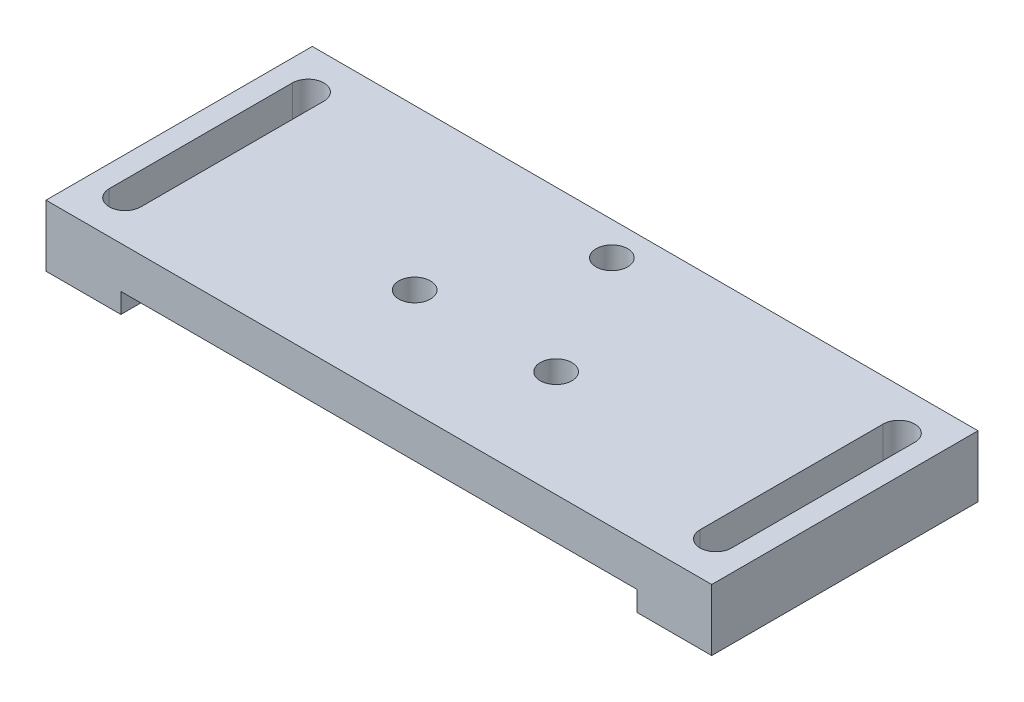
ISO-10303-21;
HEADER;
FILE_DESCRIPTION(('STEP AP214'),'2;1');
FILE_NAME('part.step','',(''),(''),'','','');
FILE_SCHEMA(('AUTOMOTIVE_DESIGN { 1 0 10303 214 1 1 1 1 }'));
ENDSEC;
DATA;
#1=APPLICATION_CONTEXT('core data for automotive mechanical design processes');
#2=APPLICATION_PROTOCOL_DEFINITION('international standard','automotive_design',2000,#1);
#3=PRODUCT_CONTEXT('',#1,'mechanical');
#4=PRODUCT('Part','Part','',(#3));
#5=PRODUCT_RELATED_PRODUCT_CATEGORY('part','',(#4));
#6=PRODUCT_DEFINITION_FORMATION('','',#4);
#7=PRODUCT_DEFINITION_CONTEXT('part definition',#1,'design');
#8=PRODUCT_DEFINITION('design','',#6,#7);
#9=PRODUCT_DEFINITION_SHAPE('','',#8);
#10=(LENGTH_UNIT() NAMED_UNIT(*) SI_UNIT(.MILLI.,.METRE.));
#11=(NAMED_UNIT(*) PLANE_ANGLE_UNIT() SI_UNIT($,.RADIAN.));
#12=(NAMED_UNIT(*) SI_UNIT($,.STERADIAN.) SOLID_ANGLE_UNIT());
#13=UNCERTAINTY_MEASURE_WITH_UNIT(LENGTH_MEASURE(1.E-05),#10,'distance_accuracy_value','');
#14=(GEOMETRIC_REPRESENTATION_CONTEXT(3) GLOBAL_UNCERTAINTY_ASSIGNED_CONTEXT((#13)) GLOBAL_UNIT_ASSIGNED_CONTEXT((#10,
#11,#12)) REPRESENTATION_CONTEXT('',''));
#15=CARTESIAN_POINT('',(0.,0.,0.));
#16=DIRECTION('',(0.,0.,1.));
#17=DIRECTION('',(1.,0.,0.));
#18=AXIS2_PLACEMENT_3D('',#15,#16,#17);
#19=CARTESIAN_POINT('',(0.,2.5,0.));
#20=DIRECTION('',(0.,-1.,0.));
#21=DIRECTION('',(0.,0.,-1.));
#22=AXIS2_PLACEMENT_3D('',#19,#20,#21);
#23=PLANE('',#22);
#24=CARTESIAN_POINT('',(4.25,2.5,1.6));
#25=DIRECTION('',(0.,1.,0.));
#26=DIRECTION('',(0.,0.,1.));
#27=AXIS2_PLACEMENT_3D('',#24,#25,#26);
#28=CIRCLE('',#27,0.95);
#29=CARTESIAN_POINT('',(4.25,2.5,2.55));
#30=VERTEX_POINT('',#29);
#31=EDGE_CURVE('E279',#30,#30,#28,.T.);
#32=ORIENTED_EDGE('',*,*,#31,.F.);
#33=EDGE_LOOP('',(#32));
#34=FACE_BOUND('',#33,.T.);
#35=CARTESIAN_POINT('',(-4.25,2.5,1.6));
#36=DIRECTION('',(0.,1.,0.));
#37=DIRECTION('',(0.,0.,1.));
#38=AXIS2_PLACEMENT_3D('',#35,#36,#37);
#39=CIRCLE('',#38,0.95);
#40=CARTESIAN_POINT('',(-4.25,2.5,2.55));
#41=VERTEX_POINT('',#40);
#42=EDGE_CURVE('E538',#41,#41,#39,.T.);
#43=ORIENTED_EDGE('',*,*,#42,.F.);
#44=EDGE_LOOP('',(#43));
#45=FACE_BOUND('',#44,.T.);
#46=CARTESIAN_POINT('',(0.,2.5,-6.));
#47=DIRECTION('',(0.,1.,0.));
#48=DIRECTION('',(0.,0.,1.));
#49=AXIS2_PLACEMENT_3D('',#46,#47,#48);
#50=CIRCLE('',#49,0.95);
#51=CARTESIAN_POINT('',(0.,2.5,-5.05));
#52=VERTEX_POINT('',#51);
#53=EDGE_CURVE('E170',#52,#52,#50,.T.);
#54=ORIENTED_EDGE('',*,*,#53,.F.);
#55=EDGE_LOOP('',(#54));
#56=FACE_BOUND('',#55,.T.);
#57=DIRECTION('',(0.,0.,-1.));
#58=VECTOR('',#57,1.);
#59=CARTESIAN_POINT('',(20.,2.5,8.));
#60=LINE('',#59,#58);
#61=CARTESIAN_POINT('',(20.,2.5,8.));
#62=VERTEX_POINT('',#61);
#63=CARTESIAN_POINT('',(20.,2.5,-8.));
#64=VERTEX_POINT('',#63);
#65=EDGE_CURVE('E258',#62,#64,#60,.T.);
#66=ORIENTED_EDGE('',*,*,#65,.T.);
#67=DIRECTION('',(-1.,0.,0.));
#68=VECTOR('',#67,1.);
#69=CARTESIAN_POINT('',(-20.,2.5,-8.));
#70=LINE('',#69,#68);
#71=CARTESIAN_POINT('',(-20.,2.5,-8.));
#72=VERTEX_POINT('',#71);
#73=EDGE_CURVE('E261',#64,#72,#70,.T.);
#74=ORIENTED_EDGE('',*,*,#73,.T.);
#75=DIRECTION('',(0.,0.,1.));
#76=VECTOR('',#75,1.);
#77=CARTESIAN_POINT('',(-20.,2.5,8.));
#78=LINE('',#77,#76);
#79=CARTESIAN_POINT('',(-20.,2.5,8.));
#80=VERTEX_POINT('',#79);
#81=EDGE_CURVE('E264',#72,#80,#78,.T.);
#82=ORIENTED_EDGE('',*,*,#81,.T.);
#83=DIRECTION('',(1.,0.,0.));
#84=VECTOR('',#83,1.);
#85=CARTESIAN_POINT('',(-20.,2.5,8.));
#86=LINE('',#85,#84);
#87=EDGE_CURVE('E266',#80,#62,#86,.T.);
#88=ORIENTED_EDGE('',*,*,#87,.T.);
#89=EDGE_LOOP('',(#66,#74,#82,#88));
#90=FACE_BOUND('',#89,.T.);
#91=DIRECTION('',(0.,0.,1.));
#92=VECTOR('',#91,1.);
#93=CARTESIAN_POINT('',(-16.8,2.5,5.5));
#94=LINE('',#93,#92);
#95=CARTESIAN_POINT('',(-16.8,2.5,-5.5));
#96=VERTEX_POINT('',#95);
#97=CARTESIAN_POINT('',(-16.8,2.5,5.5));
#98=VERTEX_POINT('',#97);
#99=EDGE_CURVE('E215',#96,#98,#94,.T.);
#100=ORIENTED_EDGE('',*,*,#99,.T.);
#101=CARTESIAN_POINT('',(-17.75,2.5,5.5));
#102=DIRECTION('',(0.,-1.,0.));
#103=DIRECTION('',(0.,0.,-1.));
#104=AXIS2_PLACEMENT_3D('',#101,#102,#103);
#105=CIRCLE('',#104,0.950000000000003);
#106=CARTESIAN_POINT('',(-18.7,2.5,5.5));
#107=VERTEX_POINT('',#106);
#108=EDGE_CURVE('E205',#98,#107,#105,.T.);
#109=ORIENTED_EDGE('',*,*,#108,.T.);
#110=DIRECTION('',(0.,0.,-1.));
#111=VECTOR('',#110,1.);
#112=CARTESIAN_POINT('',(-18.7,2.5,5.5));
#113=LINE('',#112,#111);
#114=CARTESIAN_POINT('',(-18.7,2.5,-5.5));
#115=VERTEX_POINT('',#114);
#116=EDGE_CURVE('E208',#107,#115,#113,.T.);
#117=ORIENTED_EDGE('',*,*,#116,.T.);
#118=CARTESIAN_POINT('',(-17.75,2.5,-5.5));
#119=DIRECTION('',(0.,-1.,0.));
#120=DIRECTION('',(0.,0.,-1.));
#121=AXIS2_PLACEMENT_3D('',#118,#119,#120);
#122=CIRCLE('',#121,0.950000000000005);
#123=EDGE_CURVE('E212',#115,#96,#122,.T.);
#124=ORIENTED_EDGE('',*,*,#123,.T.);
#125=EDGE_LOOP('',(#100,#109,#117,#124));
#126=FACE_BOUND('',#125,.T.);
#127=CARTESIAN_POINT('',(17.75,2.5,5.5));
#128=DIRECTION('',(0.,1.,0.));
#129=DIRECTION('',(0.,0.,-1.));
#130=AXIS2_PLACEMENT_3D('',#127,#128,#129);
#131=CIRCLE('',#130,0.950000000000003);
#132=CARTESIAN_POINT('',(16.8,2.5,5.5));
#133=VERTEX_POINT('',#132);
#134=CARTESIAN_POINT('',(18.7,2.5,5.5));
#135=VERTEX_POINT('',#134);
#136=EDGE_CURVE('E157',#133,#135,#131,.T.);
#137=ORIENTED_EDGE('',*,*,#136,.F.);
#138=DIRECTION('',(0.,0.,1.));
#139=VECTOR('',#138,1.);
#140=CARTESIAN_POINT('',(16.8,2.5,5.5));
#141=LINE('',#140,#139);
#142=CARTESIAN_POINT('',(16.8,2.5,-5.5));
#143=VERTEX_POINT('',#142);
#144=EDGE_CURVE('E149',#143,#133,#141,.T.);
#145=ORIENTED_EDGE('',*,*,#144,.F.);
#146=CARTESIAN_POINT('',(17.75,2.5,-5.5));
#147=DIRECTION('',(0.,1.,0.));
#148=DIRECTION('',(0.,0.,-1.));
#149=AXIS2_PLACEMENT_3D('',#146,#147,#148);
#150=CIRCLE('',#149,0.950000000000005);
#151=CARTESIAN_POINT('',(18.7,2.5,-5.5));
#152=VERTEX_POINT('',#151);
#153=EDGE_CURVE('E156',#152,#143,#150,.T.);
#154=ORIENTED_EDGE('',*,*,#153,.F.);
#155=DIRECTION('',(0.,0.,-1.));
#156=VECTOR('',#155,1.);
#157=CARTESIAN_POINT('',(18.7,2.5,5.5));
#158=LINE('',#157,#156);
#159=EDGE_CURVE('E161',#135,#152,#158,.T.);
#160=ORIENTED_EDGE('',*,*,#159,.F.);
#161=EDGE_LOOP('',(#137,#145,#154,#160));
#162=FACE_BOUND('',#161,.T.);
#163=ADVANCED_FACE('F35',(#34,#45,#56,#90,#126,#162),#23,.F.);
#164=CARTESIAN_POINT('',(0.,-1.2,0.));
#165=DIRECTION('',(0.,-1.,0.));
#166=DIRECTION('',(0.,0.,-1.));
#167=AXIS2_PLACEMENT_3D('',#164,#165,#166);
#168=PLANE('',#167);
#169=DIRECTION('',(0.,0.,-1.));
#170=VECTOR('',#169,1.);
#171=CARTESIAN_POINT('',(20.,-1.2,8.));
#172=LINE('',#171,#170);
#173=CARTESIAN_POINT('',(20.,-1.2,8.));
#174=VERTEX_POINT('',#173);
#175=CARTESIAN_POINT('',(20.,-1.2,-8.));
#176=VERTEX_POINT('',#175);
#177=EDGE_CURVE('E192',#174,#176,#172,.T.);
#178=ORIENTED_EDGE('',*,*,#177,.F.);
#179=DIRECTION('',(1.,0.,0.));
#180=VECTOR('',#179,1.);
#181=CARTESIAN_POINT('',(20.,-1.2,8.));
#182=LINE('',#181,#180);
#183=CARTESIAN_POINT('',(15.5,-1.2,8.));
#184=VERTEX_POINT('',#183);
#185=EDGE_CURVE('E196',#184,#174,#182,.T.);
#186=ORIENTED_EDGE('',*,*,#185,.F.);
#187=DIRECTION('',(0.,0.,1.));
#188=VECTOR('',#187,1.);
#189=CARTESIAN_POINT('',(15.5,-1.2,8.));
#190=LINE('',#189,#188);
#191=CARTESIAN_POINT('',(15.5,-1.2,-8.));
#192=VERTEX_POINT('',#191);
#193=EDGE_CURVE('E200',#192,#184,#190,.T.);
#194=ORIENTED_EDGE('',*,*,#193,.F.);
#195=DIRECTION('',(-1.,0.,0.));
#196=VECTOR('',#195,1.);
#197=CARTESIAN_POINT('',(20.,-1.2,-8.));
#198=LINE('',#197,#196);
#199=EDGE_CURVE('E188',#176,#192,#198,.T.);
#200=ORIENTED_EDGE('',*,*,#199,.F.);
#201=EDGE_LOOP('',(#178,#186,#194,#200));
#202=FACE_BOUND('',#201,.T.);
#203=DIRECTION('',(0.,0.,1.));
#204=VECTOR('',#203,1.);
#205=CARTESIAN_POINT('',(16.8,-1.2,5.5));
#206=LINE('',#205,#204);
#207=CARTESIAN_POINT('',(16.8,-1.2,-5.5));
#208=VERTEX_POINT('',#207);
#209=CARTESIAN_POINT('',(16.8,-1.2,5.5));
#210=VERTEX_POINT('',#209);
#211=EDGE_CURVE('E176',#208,#210,#206,.T.);
#212=ORIENTED_EDGE('',*,*,#211,.T.);
#213=CARTESIAN_POINT('',(17.75,-1.2,5.5));
#214=DIRECTION('',(0.,1.,0.));
#215=DIRECTION('',(0.,0.,-1.));
#216=AXIS2_PLACEMENT_3D('',#213,#214,#215);
#217=CIRCLE('',#216,0.950000000000003);
#218=CARTESIAN_POINT('',(18.7,-1.2,5.5));
#219=VERTEX_POINT('',#218);
#220=EDGE_CURVE('E60',#210,#219,#217,.T.);
#221=ORIENTED_EDGE('',*,*,#220,.T.);
#222=DIRECTION('',(0.,0.,-1.));
#223=VECTOR('',#222,1.);
#224=CARTESIAN_POINT('',(18.7,-1.2,5.5));
#225=LINE('',#224,#223);
#226=CARTESIAN_POINT('',(18.7,-1.2,-5.5));
#227=VERTEX_POINT('',#226);
#228=EDGE_CURVE('E164',#219,#227,#225,.T.);
#229=ORIENTED_EDGE('',*,*,#228,.T.);
#230=CARTESIAN_POINT('',(17.75,-1.2,-5.5));
#231=DIRECTION('',(0.,1.,0.));
#232=DIRECTION('',(0.,0.,-1.));
#233=AXIS2_PLACEMENT_3D('',#230,#231,#232);
#234=CIRCLE('',#233,0.950000000000005);
#235=EDGE_CURVE('E167',#227,#208,#234,.T.);
#236=ORIENTED_EDGE('',*,*,#235,.T.);
#237=EDGE_LOOP('',(#212,#221,#229,#236));
#238=FACE_BOUND('',#237,.T.);
#239=ADVANCED_FACE('F329',(#202,#238),#168,.T.);
#240=CARTESIAN_POINT('',(20.,2.5,8.));
#241=DIRECTION('',(-1.,0.,0.));
#242=DIRECTION('',(0.,0.,1.));
#243=AXIS2_PLACEMENT_3D('',#240,#241,#242);
#244=PLANE('',#243);
#245=DIRECTION('',(0.,-1.,0.));
#246=VECTOR('',#245,1.);
#247=CARTESIAN_POINT('',(20.,2.5,8.));
#248=LINE('',#247,#246);
#249=EDGE_CURVE('E268',#62,#174,#248,.T.);
#250=ORIENTED_EDGE('',*,*,#249,.T.);
#251=ORIENTED_EDGE('',*,*,#177,.T.);
#252=DIRECTION('',(0.,-1.,0.));
#253=VECTOR('',#252,1.);
#254=CARTESIAN_POINT('',(20.,2.5,-8.));
#255=LINE('',#254,#253);
#256=EDGE_CURVE('E12',#64,#176,#255,.T.);
#257=ORIENTED_EDGE('',*,*,#256,.F.);
#258=ORIENTED_EDGE('',*,*,#65,.F.);
#259=EDGE_LOOP('',(#250,#251,#257,#258));
#260=FACE_BOUND('',#259,.T.);
#261=ADVANCED_FACE('F37',(#260),#244,.F.);
#262=CARTESIAN_POINT('',(-20.,2.5,-8.));
#263=DIRECTION('',(0.,0.,1.));
#264=DIRECTION('',(1.,0.,0.));
#265=AXIS2_PLACEMENT_3D('',#262,#263,#264);
#266=PLANE('',#265);
#267=ORIENTED_EDGE('',*,*,#256,.T.);
#268=ORIENTED_EDGE('',*,*,#199,.T.);
#269=DIRECTION('',(0.,1.,0.));
#270=VECTOR('',#269,1.);
#271=CARTESIAN_POINT('',(15.5,-21.5207701385947,-8.));
#272=LINE('',#271,#270);
#273=CARTESIAN_POINT('',(15.5,0.,-8.));
#274=VERTEX_POINT('',#273);
#275=EDGE_CURVE('E191',#192,#274,#272,.T.);
#276=ORIENTED_EDGE('',*,*,#275,.T.);
#277=DIRECTION('',(-1.,0.,0.));
#278=VECTOR('',#277,1.);
#279=CARTESIAN_POINT('',(-20.,0.,-8.));
#280=LINE('',#279,#278);
#281=CARTESIAN_POINT('',(-15.5,0.,-8.));
#282=VERTEX_POINT('',#281);
#283=EDGE_CURVE('E244',#274,#282,#280,.T.);
#284=ORIENTED_EDGE('',*,*,#283,.T.);
#285=DIRECTION('',(0.,1.,0.));
#286=VECTOR('',#285,1.);
#287=CARTESIAN_POINT('',(-15.5,-21.5207701385947,-8.));
#288=LINE('',#287,#286);
#289=CARTESIAN_POINT('',(-15.5,-1.2,-8.));
#290=VERTEX_POINT('',#289);
#291=EDGE_CURVE('E230',#290,#282,#288,.T.);
#292=ORIENTED_EDGE('',*,*,#291,.F.);
#293=DIRECTION('',(1.,0.,0.));
#294=VECTOR('',#293,1.);
#295=CARTESIAN_POINT('',(-20.,-1.2,-8.));
#296=LINE('',#295,#294);
#297=CARTESIAN_POINT('',(-20.,-1.2,-8.));
#298=VERTEX_POINT('',#297);
#299=EDGE_CURVE('E245',#298,#290,#296,.T.);
#300=ORIENTED_EDGE('',*,*,#299,.F.);
#301=DIRECTION('',(0.,-1.,0.));
#302=VECTOR('',#301,1.);
#303=CARTESIAN_POINT('',(-20.,2.5,-8.));
#304=LINE('',#303,#302);
#305=EDGE_CURVE('E44',#72,#298,#304,.T.);
#306=ORIENTED_EDGE('',*,*,#305,.F.);
#307=ORIENTED_EDGE('',*,*,#73,.F.);
#308=EDGE_LOOP('',(#267,#268,#276,#284,#292,#300,#306,#307));
#309=FACE_BOUND('',#308,.T.);
#310=ADVANCED_FACE('F310',(#309),#266,.F.);
#311=CARTESIAN_POINT('',(-20.,2.5,8.));
#312=DIRECTION('',(1.,0.,0.));
#313=DIRECTION('',(0.,0.,-1.));
#314=AXIS2_PLACEMENT_3D('',#311,#312,#313);
#315=PLANE('',#314);
#316=ORIENTED_EDGE('',*,*,#305,.T.);
#317=DIRECTION('',(0.,0.,-1.));
#318=VECTOR('',#317,1.);
#319=CARTESIAN_POINT('',(-20.,-1.2,8.));
#320=LINE('',#319,#318);
#321=CARTESIAN_POINT('',(-20.,-1.2,8.));
#322=VERTEX_POINT('',#321);
#323=EDGE_CURVE('E248',#322,#298,#320,.T.);
#324=ORIENTED_EDGE('',*,*,#323,.F.);
#325=DIRECTION('',(0.,-1.,0.));
#326=VECTOR('',#325,1.);
#327=CARTESIAN_POINT('',(-20.,2.5,8.));
#328=LINE('',#327,#326);
#329=EDGE_CURVE('E273',#80,#322,#328,.T.);
#330=ORIENTED_EDGE('',*,*,#329,.F.);
#331=ORIENTED_EDGE('',*,*,#81,.F.);
#332=EDGE_LOOP('',(#316,#324,#330,#331));
#333=FACE_BOUND('',#332,.T.);
#334=ADVANCED_FACE('F317',(#333),#315,.F.);
#335=CARTESIAN_POINT('',(-20.,2.5,8.));
#336=DIRECTION('',(0.,0.,-1.));
#337=DIRECTION('',(-1.,0.,0.));
#338=AXIS2_PLACEMENT_3D('',#335,#336,#337);
#339=PLANE('',#338);
#340=ORIENTED_EDGE('',*,*,#329,.T.);
#341=DIRECTION('',(-1.,0.,0.));
#342=VECTOR('',#341,1.);
#343=CARTESIAN_POINT('',(-20.,-1.2,8.));
#344=LINE('',#343,#342);
#345=CARTESIAN_POINT('',(-15.5,-1.2,8.));
#346=VERTEX_POINT('',#345);
#347=EDGE_CURVE('E251',#346,#322,#344,.T.);
#348=ORIENTED_EDGE('',*,*,#347,.F.);
#349=DIRECTION('',(0.,1.,0.));
#350=VECTOR('',#349,1.);
#351=CARTESIAN_POINT('',(-15.5,-21.5207701385947,8.));
#352=LINE('',#351,#350);
#353=CARTESIAN_POINT('',(-15.5,0.,8.));
#354=VERTEX_POINT('',#353);
#355=EDGE_CURVE('E240',#346,#354,#352,.T.);
#356=ORIENTED_EDGE('',*,*,#355,.T.);
#357=DIRECTION('',(1.,0.,0.));
#358=VECTOR('',#357,1.);
#359=CARTESIAN_POINT('',(-20.,0.,8.));
#360=LINE('',#359,#358);
#361=CARTESIAN_POINT('',(15.5,0.,8.));
#362=VERTEX_POINT('',#361);
#363=EDGE_CURVE('E262',#354,#362,#360,.T.);
#364=ORIENTED_EDGE('',*,*,#363,.T.);
#365=DIRECTION('',(0.,1.,0.));
#366=VECTOR('',#365,1.);
#367=CARTESIAN_POINT('',(15.5,-21.5207701385947,8.));
#368=LINE('',#367,#366);
#369=EDGE_CURVE('E199',#184,#362,#368,.T.);
#370=ORIENTED_EDGE('',*,*,#369,.F.);
#371=ORIENTED_EDGE('',*,*,#185,.T.);
#372=ORIENTED_EDGE('',*,*,#249,.F.);
#373=ORIENTED_EDGE('',*,*,#87,.F.);
#374=EDGE_LOOP('',(#340,#348,#356,#364,#370,#371,#372,#373));
#375=FACE_BOUND('',#374,.T.);
#376=ADVANCED_FACE('F293',(#375),#339,.F.);
#377=CARTESIAN_POINT('',(0.,0.,0.));
#378=DIRECTION('',(0.,-1.,0.));
#379=DIRECTION('',(0.,0.,-1.));
#380=AXIS2_PLACEMENT_3D('',#377,#378,#379);
#381=PLANE('',#380);
#382=CARTESIAN_POINT('',(4.25,0.,1.6));
#383=DIRECTION('',(0.,-1.,0.));
#384=DIRECTION('',(0.,0.,-1.));
#385=AXIS2_PLACEMENT_3D('',#382,#383,#384);
#386=CIRCLE('',#385,0.95);
#387=CARTESIAN_POINT('',(4.25,0.,0.649999999999996));
#388=VERTEX_POINT('',#387);
#389=EDGE_CURVE('E39',#388,#388,#386,.T.);
#390=ORIENTED_EDGE('',*,*,#389,.F.);
#391=EDGE_LOOP('',(#390));
#392=FACE_BOUND('',#391,.T.);
#393=CARTESIAN_POINT('',(-4.25,0.,1.6));
#394=DIRECTION('',(0.,-1.,0.));
#395=DIRECTION('',(0.,0.,-1.));
#396=AXIS2_PLACEMENT_3D('',#393,#394,#395);
#397=CIRCLE('',#396,0.95);
#398=CARTESIAN_POINT('',(-4.25,0.,0.649999999999997));
#399=VERTEX_POINT('',#398);
#400=EDGE_CURVE('E278',#399,#399,#397,.T.);
#401=ORIENTED_EDGE('',*,*,#400,.F.);
#402=EDGE_LOOP('',(#401));
#403=FACE_BOUND('',#402,.T.);
#404=CARTESIAN_POINT('',(0.,0.,-6.));
#405=DIRECTION('',(0.,-1.,0.));
#406=DIRECTION('',(0.,0.,-1.));
#407=AXIS2_PLACEMENT_3D('',#404,#405,#406);
#408=CIRCLE('',#407,0.95);
#409=CARTESIAN_POINT('',(0.,0.,-6.95));
#410=VERTEX_POINT('',#409);
#411=EDGE_CURVE('E276',#410,#410,#408,.T.);
#412=ORIENTED_EDGE('',*,*,#411,.F.);
#413=EDGE_LOOP('',(#412));
#414=FACE_BOUND('',#413,.T.);
#415=DIRECTION('',(0.,0.,1.));
#416=VECTOR('',#415,1.);
#417=CARTESIAN_POINT('',(15.5,0.,8.));
#418=LINE('',#417,#416);
#419=EDGE_CURVE('E182',#274,#362,#418,.T.);
#420=ORIENTED_EDGE('',*,*,#419,.T.);
#421=ORIENTED_EDGE('',*,*,#363,.F.);
#422=DIRECTION('',(0.,0.,1.));
#423=VECTOR('',#422,1.);
#424=CARTESIAN_POINT('',(-15.5,0.,8.));
#425=LINE('',#424,#423);
#426=EDGE_CURVE('E237',#282,#354,#425,.T.);
#427=ORIENTED_EDGE('',*,*,#426,.F.);
#428=ORIENTED_EDGE('',*,*,#283,.F.);
#429=EDGE_LOOP('',(#420,#421,#427,#428));
#430=FACE_BOUND('',#429,.T.);
#431=ADVANCED_FACE('F289',(#392,#403,#414,#430),#381,.T.);
#432=CARTESIAN_POINT('',(-15.5,-21.5207701385947,8.));
#433=DIRECTION('',(-1.,0.,0.));
#434=DIRECTION('',(0.,0.,1.));
#435=AXIS2_PLACEMENT_3D('',#432,#433,#434);
#436=PLANE('',#435);
#437=DIRECTION('',(0.,0.,1.));
#438=VECTOR('',#437,1.);
#439=CARTESIAN_POINT('',(-15.5,-1.2,8.));
#440=LINE('',#439,#438);
#441=EDGE_CURVE('E241',#290,#346,#440,.T.);
#442=ORIENTED_EDGE('',*,*,#441,.F.);
#443=ORIENTED_EDGE('',*,*,#291,.T.);
#444=ORIENTED_EDGE('',*,*,#426,.T.);
#445=ORIENTED_EDGE('',*,*,#355,.F.);
#446=EDGE_LOOP('',(#442,#443,#444,#445));
#447=FACE_BOUND('',#446,.T.);
#448=ADVANCED_FACE('F292',(#447),#436,.F.);
#449=CARTESIAN_POINT('',(0.,-1.2,0.));
#450=DIRECTION('',(0.,-1.,0.));
#451=DIRECTION('',(0.,0.,-1.));
#452=AXIS2_PLACEMENT_3D('',#449,#450,#451);
#453=PLANE('',#452);
#454=CARTESIAN_POINT('',(-17.75,-1.2,5.5));
#455=DIRECTION('',(0.,-1.,0.));
#456=DIRECTION('',(0.,0.,-1.));
#457=AXIS2_PLACEMENT_3D('',#454,#455,#456);
#458=CIRCLE('',#457,0.950000000000003);
#459=CARTESIAN_POINT('',(-16.8,-1.2,5.5));
#460=VERTEX_POINT('',#459);
#461=CARTESIAN_POINT('',(-18.7,-1.2,5.5));
#462=VERTEX_POINT('',#461);
#463=EDGE_CURVE('E195',#460,#462,#458,.T.);
#464=ORIENTED_EDGE('',*,*,#463,.F.);
#465=DIRECTION('',(0.,0.,1.));
#466=VECTOR('',#465,1.);
#467=CARTESIAN_POINT('',(-16.8,-1.2,5.5));
#468=LINE('',#467,#466);
#469=CARTESIAN_POINT('',(-16.8,-1.2,-5.5));
#470=VERTEX_POINT('',#469);
#471=EDGE_CURVE('E209',#470,#460,#468,.T.);
#472=ORIENTED_EDGE('',*,*,#471,.F.);
#473=CARTESIAN_POINT('',(-17.75,-1.2,-5.5));
#474=DIRECTION('',(0.,-1.,0.));
#475=DIRECTION('',(0.,0.,-1.));
#476=AXIS2_PLACEMENT_3D('',#473,#474,#475);
#477=CIRCLE('',#476,0.950000000000005);
#478=CARTESIAN_POINT('',(-18.7,-1.2,-5.5));
#479=VERTEX_POINT('',#478);
#480=EDGE_CURVE('E223',#479,#470,#477,.T.);
#481=ORIENTED_EDGE('',*,*,#480,.F.);
#482=DIRECTION('',(0.,0.,-1.));
#483=VECTOR('',#482,1.);
#484=CARTESIAN_POINT('',(-18.7,-1.2,5.5));
#485=LINE('',#484,#483);
#486=EDGE_CURVE('E220',#462,#479,#485,.T.);
#487=ORIENTED_EDGE('',*,*,#486,.F.);
#488=EDGE_LOOP('',(#464,#472,#481,#487));
#489=FACE_BOUND('',#488,.T.);
#490=ORIENTED_EDGE('',*,*,#347,.T.);
#491=ORIENTED_EDGE('',*,*,#323,.T.);
#492=ORIENTED_EDGE('',*,*,#299,.T.);
#493=ORIENTED_EDGE('',*,*,#441,.T.);
#494=EDGE_LOOP('',(#490,#491,#492,#493));
#495=FACE_BOUND('',#494,.T.);
#496=ADVANCED_FACE('F313',(#489,#495),#453,.T.);
#497=CARTESIAN_POINT('',(-17.75,2.5,5.5));
#498=DIRECTION('',(0.,-1.,0.));
#499=DIRECTION('',(0.,0.,-1.));
#500=AXIS2_PLACEMENT_3D('',#497,#498,#499);
#501=CYLINDRICAL_SURFACE('',#500,0.950000000000003);
#502=ORIENTED_EDGE('',*,*,#463,.T.);
#503=DIRECTION('',(0.,-1.,0.));
#504=VECTOR('',#503,1.);
#505=CARTESIAN_POINT('',(-18.7,2.5,5.5));
#506=LINE('',#505,#504);
#507=EDGE_CURVE('E218',#107,#462,#506,.T.);
#508=ORIENTED_EDGE('',*,*,#507,.F.);
#509=ORIENTED_EDGE('',*,*,#108,.F.);
#510=DIRECTION('',(0.,-1.,0.));
#511=VECTOR('',#510,1.);
#512=CARTESIAN_POINT('',(-16.8,2.5,5.5));
#513=LINE('',#512,#511);
#514=EDGE_CURVE('E228',#98,#460,#513,.T.);
#515=ORIENTED_EDGE('',*,*,#514,.T.);
#516=EDGE_LOOP('',(#502,#508,#509,#515));
#517=FACE_BOUND('',#516,.T.);
#518=ADVANCED_FACE('F396',(#517),#501,.F.);
#519=CARTESIAN_POINT('',(-16.8,2.5,5.5));
#520=DIRECTION('',(1.,0.,0.));
#521=DIRECTION('',(0.,0.,-1.));
#522=AXIS2_PLACEMENT_3D('',#519,#520,#521);
#523=PLANE('',#522);
#524=ORIENTED_EDGE('',*,*,#471,.T.);
#525=ORIENTED_EDGE('',*,*,#514,.F.);
#526=ORIENTED_EDGE('',*,*,#99,.F.);
#527=DIRECTION('',(0.,-1.,0.));
#528=VECTOR('',#527,1.);
#529=CARTESIAN_POINT('',(-16.8,2.5,-5.5));
#530=LINE('',#529,#528);
#531=EDGE_CURVE('E231',#96,#470,#530,.T.);
#532=ORIENTED_EDGE('',*,*,#531,.T.);
#533=EDGE_LOOP('',(#524,#525,#526,#532));
#534=FACE_BOUND('',#533,.T.);
#535=ADVANCED_FACE('F386',(#534),#523,.F.);
#536=CARTESIAN_POINT('',(-17.75,2.5,-5.5));
#537=DIRECTION('',(0.,-1.,0.));
#538=DIRECTION('',(0.,0.,-1.));
#539=AXIS2_PLACEMENT_3D('',#536,#537,#538);
#540=CYLINDRICAL_SURFACE('',#539,0.950000000000005);
#541=ORIENTED_EDGE('',*,*,#480,.T.);
#542=ORIENTED_EDGE('',*,*,#531,.F.);
#543=ORIENTED_EDGE('',*,*,#123,.F.);
#544=DIRECTION('',(0.,-1.,0.));
#545=VECTOR('',#544,1.);
#546=CARTESIAN_POINT('',(-18.7,2.5,-5.5));
#547=LINE('',#546,#545);
#548=EDGE_CURVE('E233',#115,#479,#547,.T.);
#549=ORIENTED_EDGE('',*,*,#548,.T.);
#550=EDGE_LOOP('',(#541,#542,#543,#549));
#551=FACE_BOUND('',#550,.T.);
#552=ADVANCED_FACE('F341',(#551),#540,.F.);
#553=CARTESIAN_POINT('',(-18.7,2.5,5.5));
#554=DIRECTION('',(-1.,0.,0.));
#555=DIRECTION('',(0.,0.,1.));
#556=AXIS2_PLACEMENT_3D('',#553,#554,#555);
#557=PLANE('',#556);
#558=ORIENTED_EDGE('',*,*,#486,.T.);
#559=ORIENTED_EDGE('',*,*,#548,.F.);
#560=ORIENTED_EDGE('',*,*,#116,.F.);
#561=ORIENTED_EDGE('',*,*,#507,.T.);
#562=EDGE_LOOP('',(#558,#559,#560,#561));
#563=FACE_BOUND('',#562,.T.);
#564=ADVANCED_FACE('F333',(#563),#557,.F.);
#565=CARTESIAN_POINT('',(15.5,-21.5207701385947,8.));
#566=DIRECTION('',(-1.,0.,0.));
#567=DIRECTION('',(0.,0.,1.));
#568=AXIS2_PLACEMENT_3D('',#565,#566,#567);
#569=PLANE('',#568);
#570=ORIENTED_EDGE('',*,*,#275,.F.);
#571=ORIENTED_EDGE('',*,*,#193,.T.);
#572=ORIENTED_EDGE('',*,*,#369,.T.);
#573=ORIENTED_EDGE('',*,*,#419,.F.);
#574=EDGE_LOOP('',(#570,#571,#572,#573));
#575=FACE_BOUND('',#574,.T.);
#576=ADVANCED_FACE('F331',(#575),#569,.T.);
#577=CARTESIAN_POINT('',(17.75,2.5,5.5));
#578=DIRECTION('',(0.,-1.,0.));
#579=DIRECTION('',(0.,0.,-1.));
#580=AXIS2_PLACEMENT_3D('',#577,#578,#579);
#581=CYLINDRICAL_SURFACE('',#580,0.950000000000003);
#582=ORIENTED_EDGE('',*,*,#220,.F.);
#583=DIRECTION('',(0.,-1.,0.));
#584=VECTOR('',#583,1.);
#585=CARTESIAN_POINT('',(16.8,2.5,5.5));
#586=LINE('',#585,#584);
#587=EDGE_CURVE('E151',#133,#210,#586,.T.);
#588=ORIENTED_EDGE('',*,*,#587,.F.);
#589=ORIENTED_EDGE('',*,*,#136,.T.);
#590=DIRECTION('',(0.,-1.,0.));
#591=VECTOR('',#590,1.);
#592=CARTESIAN_POINT('',(18.7,2.5,5.5));
#593=LINE('',#592,#591);
#594=EDGE_CURVE('E180',#135,#219,#593,.T.);
#595=ORIENTED_EDGE('',*,*,#594,.T.);
#596=EDGE_LOOP('',(#582,#588,#589,#595));
#597=FACE_BOUND('',#596,.T.);
#598=ADVANCED_FACE('F159',(#597),#581,.F.);
#599=CARTESIAN_POINT('',(18.7,2.5,5.5));
#600=DIRECTION('',(-1.,0.,0.));
#601=DIRECTION('',(0.,0.,1.));
#602=AXIS2_PLACEMENT_3D('',#599,#600,#601);
#603=PLANE('',#602);
#604=ORIENTED_EDGE('',*,*,#228,.F.);
#605=ORIENTED_EDGE('',*,*,#594,.F.);
#606=ORIENTED_EDGE('',*,*,#159,.T.);
#607=DIRECTION('',(0.,-1.,0.));
#608=VECTOR('',#607,1.);
#609=CARTESIAN_POINT('',(18.7,2.5,-5.5));
#610=LINE('',#609,#608);
#611=EDGE_CURVE('E183',#152,#227,#610,.T.);
#612=ORIENTED_EDGE('',*,*,#611,.T.);
#613=EDGE_LOOP('',(#604,#605,#606,#612));
#614=FACE_BOUND('',#613,.T.);
#615=ADVANCED_FACE('F339',(#614),#603,.T.);
#616=CARTESIAN_POINT('',(17.75,2.5,-5.5));
#617=DIRECTION('',(0.,-1.,0.));
#618=DIRECTION('',(0.,0.,-1.));
#619=AXIS2_PLACEMENT_3D('',#616,#617,#618);
#620=CYLINDRICAL_SURFACE('',#619,0.950000000000005);
#621=ORIENTED_EDGE('',*,*,#235,.F.);
#622=ORIENTED_EDGE('',*,*,#611,.F.);
#623=ORIENTED_EDGE('',*,*,#153,.T.);
#624=DIRECTION('',(0.,-1.,0.));
#625=VECTOR('',#624,1.);
#626=CARTESIAN_POINT('',(16.8,2.5,-5.5));
#627=LINE('',#626,#625);
#628=EDGE_CURVE('E52',#143,#208,#627,.T.);
#629=ORIENTED_EDGE('',*,*,#628,.T.);
#630=EDGE_LOOP('',(#621,#622,#623,#629));
#631=FACE_BOUND('',#630,.T.);
#632=ADVANCED_FACE('F479',(#631),#620,.F.);
#633=CARTESIAN_POINT('',(16.8,2.5,5.5));
#634=DIRECTION('',(1.,0.,0.));
#635=DIRECTION('',(0.,0.,-1.));
#636=AXIS2_PLACEMENT_3D('',#633,#634,#635);
#637=PLANE('',#636);
#638=ORIENTED_EDGE('',*,*,#211,.F.);
#639=ORIENTED_EDGE('',*,*,#628,.F.);
#640=ORIENTED_EDGE('',*,*,#144,.T.);
#641=ORIENTED_EDGE('',*,*,#587,.T.);
#642=EDGE_LOOP('',(#638,#639,#640,#641));
#643=FACE_BOUND('',#642,.T.);
#644=ADVANCED_FACE('F150',(#643),#637,.T.);
#645=CARTESIAN_POINT('',(0.,-1.2,-6.));
#646=DIRECTION('',(0.,1.,0.));
#647=DIRECTION('',(0.,0.,1.));
#648=AXIS2_PLACEMENT_3D('',#645,#646,#647);
#649=CYLINDRICAL_SURFACE('',#648,0.95);
#650=ORIENTED_EDGE('',*,*,#411,.T.);
#651=EDGE_LOOP('',(#650));
#652=FACE_BOUND('',#651,.T.);
#653=ORIENTED_EDGE('',*,*,#53,.T.);
#654=EDGE_LOOP('',(#653));
#655=FACE_BOUND('',#654,.T.);
#656=ADVANCED_FACE('F448',(#652,#655),#649,.F.);
#657=CARTESIAN_POINT('',(-4.25,-1.2,1.6));
#658=DIRECTION('',(0.,1.,0.));
#659=DIRECTION('',(0.,0.,1.));
#660=AXIS2_PLACEMENT_3D('',#657,#658,#659);
#661=CYLINDRICAL_SURFACE('',#660,0.95);
#662=ORIENTED_EDGE('',*,*,#400,.T.);
#663=EDGE_LOOP('',(#662));
#664=FACE_BOUND('',#663,.T.);
#665=ORIENTED_EDGE('',*,*,#42,.T.);
#666=EDGE_LOOP('',(#665));
#667=FACE_BOUND('',#666,.T.);
#668=ADVANCED_FACE('F453',(#664,#667),#661,.F.);
#669=CARTESIAN_POINT('',(4.25,-1.2,1.6));
#670=DIRECTION('',(0.,1.,0.));
#671=DIRECTION('',(0.,0.,1.));
#672=AXIS2_PLACEMENT_3D('',#669,#670,#671);
#673=CYLINDRICAL_SURFACE('',#672,0.95);
#674=ORIENTED_EDGE('',*,*,#389,.T.);
#675=EDGE_LOOP('',(#674));
#676=FACE_BOUND('',#675,.T.);
#677=ORIENTED_EDGE('',*,*,#31,.T.);
#678=EDGE_LOOP('',(#677));
#679=FACE_BOUND('',#678,.T.);
#680=ADVANCED_FACE('F286',(#676,#679),#673,.F.);
#681=CLOSED_SHELL('',(#163,#239,#261,#310,#334,#376,#431,#448,#496,#518,#535,#552,#564,#576,
#598,#615,#632,#644,#656,#668,#680));
#682=MANIFOLD_SOLID_BREP('B2',#681);
#683=ADVANCED_BREP_SHAPE_REPRESENTATION('',(#18,#682),#14);
#684=SHAPE_DEFINITION_REPRESENTATION(#9,#683);
ENDSEC;
END-ISO-10303-21;
